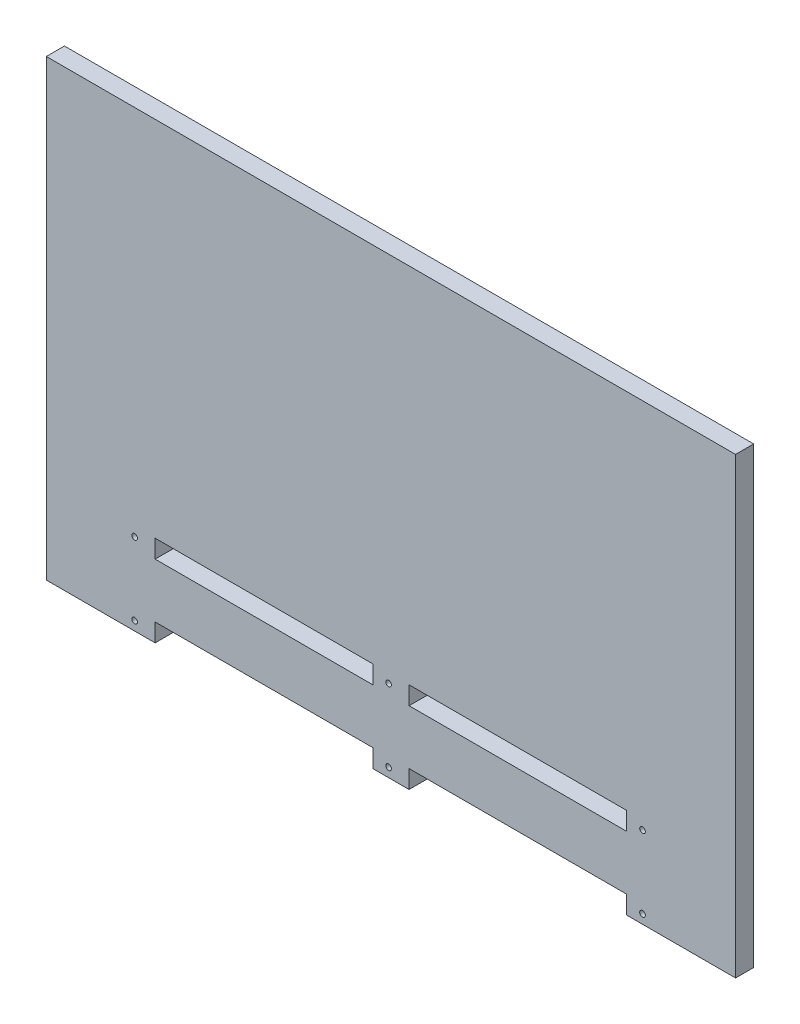
ISO-10303-21;
HEADER;
FILE_DESCRIPTION(('STEP AP214'),'2;1');
FILE_NAME('part.step','',(''),(''),'','','');
FILE_SCHEMA(('AUTOMOTIVE_DESIGN { 1 0 10303 214 1 1 1 1 }'));
ENDSEC;
DATA;
#1=APPLICATION_CONTEXT('core data for automotive mechanical design processes');
#2=APPLICATION_PROTOCOL_DEFINITION('international standard','automotive_design',2000,#1);
#3=PRODUCT_CONTEXT('',#1,'mechanical');
#4=PRODUCT('Part','Part','',(#3));
#5=PRODUCT_RELATED_PRODUCT_CATEGORY('part','',(#4));
#6=PRODUCT_DEFINITION_FORMATION('','',#4);
#7=PRODUCT_DEFINITION_CONTEXT('part definition',#1,'design');
#8=PRODUCT_DEFINITION('design','',#6,#7);
#9=PRODUCT_DEFINITION_SHAPE('','',#8);
#10=(LENGTH_UNIT() NAMED_UNIT(*) SI_UNIT(.MILLI.,.METRE.));
#11=(NAMED_UNIT(*) PLANE_ANGLE_UNIT() SI_UNIT($,.RADIAN.));
#12=(NAMED_UNIT(*) SI_UNIT($,.STERADIAN.) SOLID_ANGLE_UNIT());
#13=UNCERTAINTY_MEASURE_WITH_UNIT(LENGTH_MEASURE(1.E-05),#10,'distance_accuracy_value','');
#14=(GEOMETRIC_REPRESENTATION_CONTEXT(3) GLOBAL_UNCERTAINTY_ASSIGNED_CONTEXT((#13)) GLOBAL_UNIT_ASSIGNED_CONTEXT((#10,
#11,#12)) REPRESENTATION_CONTEXT('',''));
#15=CARTESIAN_POINT('',(0.,0.,0.));
#16=DIRECTION('',(0.,0.,1.));
#17=DIRECTION('',(1.,0.,0.));
#18=AXIS2_PLACEMENT_3D('',#15,#16,#17);
#19=CARTESIAN_POINT('',(0.,-200.,10.));
#20=DIRECTION('',(0.,1.,0.));
#21=DIRECTION('',(-1.,0.,0.));
#22=AXIS2_PLACEMENT_3D('',#19,#20,#21);
#23=PLANE('',#22);
#24=DIRECTION('',(1.,0.,0.));
#25=VECTOR('',#24,1.);
#26=CARTESIAN_POINT('',(0.,-200.,0.));
#27=LINE('',#26,#25);
#28=CARTESIAN_POINT('',(10.,-200.,0.));
#29=VERTEX_POINT('',#28);
#30=CARTESIAN_POINT('',(130.,-200.,0.));
#31=VERTEX_POINT('',#30);
#32=EDGE_CURVE('E264',#29,#31,#27,.T.);
#33=ORIENTED_EDGE('',*,*,#32,.T.);
#34=DIRECTION('',(0.,0.,-1.));
#35=VECTOR('',#34,1.);
#36=CARTESIAN_POINT('',(130.,-200.,10.));
#37=LINE('',#36,#35);
#38=CARTESIAN_POINT('',(130.,-200.,10.));
#39=VERTEX_POINT('',#38);
#40=EDGE_CURVE('E11',#39,#31,#37,.T.);
#41=ORIENTED_EDGE('',*,*,#40,.F.);
#42=DIRECTION('',(1.,0.,0.));
#43=VECTOR('',#42,1.);
#44=CARTESIAN_POINT('',(0.,-200.,10.));
#45=LINE('',#44,#43);
#46=CARTESIAN_POINT('',(10.,-200.,10.));
#47=VERTEX_POINT('',#46);
#48=EDGE_CURVE('E186',#47,#39,#45,.T.);
#49=ORIENTED_EDGE('',*,*,#48,.F.);
#50=DIRECTION('',(0.,0.,-1.));
#51=VECTOR('',#50,1.);
#52=CARTESIAN_POINT('',(10.,-200.,10.));
#53=LINE('',#52,#51);
#54=EDGE_CURVE('E54',#47,#29,#53,.T.);
#55=ORIENTED_EDGE('',*,*,#54,.T.);
#56=EDGE_LOOP('',(#33,#41,#49,#55));
#57=FACE_BOUND('',#56,.T.);
#58=ADVANCED_FACE('F35',(#57),#23,.F.);
#59=CARTESIAN_POINT('',(129.999999999999,3.60822483003174E-13,10.));
#60=DIRECTION('',(1.,0.,0.));
#61=DIRECTION('',(0.,1.,0.));
#62=AXIS2_PLACEMENT_3D('',#59,#60,#61);
#63=PLANE('',#62);
#64=DIRECTION('',(0.,-1.,0.));
#65=VECTOR('',#64,1.);
#66=CARTESIAN_POINT('',(129.999999999999,3.60822483003174E-13,0.));
#67=LINE('',#66,#65);
#68=CARTESIAN_POINT('',(130.,-210.,0.));
#69=VERTEX_POINT('',#68);
#70=EDGE_CURVE('E192',#31,#69,#67,.T.);
#71=ORIENTED_EDGE('',*,*,#70,.T.);
#72=DIRECTION('',(0.,0.,-1.));
#73=VECTOR('',#72,1.);
#74=CARTESIAN_POINT('',(130.,-210.,10.));
#75=LINE('',#74,#73);
#76=CARTESIAN_POINT('',(130.,-210.,10.));
#77=VERTEX_POINT('',#76);
#78=EDGE_CURVE('E45',#77,#69,#75,.T.);
#79=ORIENTED_EDGE('',*,*,#78,.F.);
#80=DIRECTION('',(0.,-1.,0.));
#81=VECTOR('',#80,1.);
#82=CARTESIAN_POINT('',(129.999999999999,3.60822483003174E-13,10.));
#83=LINE('',#82,#81);
#84=EDGE_CURVE('E180',#39,#77,#83,.T.);
#85=ORIENTED_EDGE('',*,*,#84,.F.);
#86=ORIENTED_EDGE('',*,*,#40,.T.);
#87=EDGE_LOOP('',(#71,#79,#85,#86));
#88=FACE_BOUND('',#87,.T.);
#89=ADVANCED_FACE('F191',(#88),#63,.F.);
#90=CARTESIAN_POINT('',(0.,-210.,10.));
#91=DIRECTION('',(0.,1.,0.));
#92=DIRECTION('',(-1.,0.,0.));
#93=AXIS2_PLACEMENT_3D('',#90,#91,#92);
#94=PLANE('',#93);
#95=DIRECTION('',(1.,0.,0.));
#96=VECTOR('',#95,1.);
#97=CARTESIAN_POINT('',(0.,-210.,0.));
#98=LINE('',#97,#96);
#99=CARTESIAN_POINT('',(10.,-210.,0.));
#100=VERTEX_POINT('',#99);
#101=EDGE_CURVE('E267',#100,#69,#98,.T.);
#102=ORIENTED_EDGE('',*,*,#101,.F.);
#103=DIRECTION('',(0.,0.,-1.));
#104=VECTOR('',#103,1.);
#105=CARTESIAN_POINT('',(10.,-210.,10.));
#106=LINE('',#105,#104);
#107=CARTESIAN_POINT('',(10.,-210.,10.));
#108=VERTEX_POINT('',#107);
#109=EDGE_CURVE('E116',#108,#100,#106,.T.);
#110=ORIENTED_EDGE('',*,*,#109,.F.);
#111=DIRECTION('',(1.,0.,0.));
#112=VECTOR('',#111,1.);
#113=CARTESIAN_POINT('',(0.,-210.,10.));
#114=LINE('',#113,#112);
#115=EDGE_CURVE('E185',#108,#77,#114,.T.);
#116=ORIENTED_EDGE('',*,*,#115,.T.);
#117=ORIENTED_EDGE('',*,*,#78,.T.);
#118=EDGE_LOOP('',(#102,#110,#116,#117));
#119=FACE_BOUND('',#118,.T.);
#120=ADVANCED_FACE('F196',(#119),#94,.T.);
#121=CARTESIAN_POINT('',(0.,-210.,10.));
#122=DIRECTION('',(0.,1.,0.));
#123=DIRECTION('',(0.,0.,1.));
#124=AXIS2_PLACEMENT_3D('',#121,#122,#123);
#125=PLANE('',#124);
#126=DIRECTION('',(1.,0.,0.));
#127=VECTOR('',#126,1.);
#128=CARTESIAN_POINT('',(0.,-210.,0.));
#129=LINE('',#128,#127);
#130=CARTESIAN_POINT('',(-130.,-210.,0.));
#131=VERTEX_POINT('',#130);
#132=CARTESIAN_POINT('',(-10.,-210.,0.));
#133=VERTEX_POINT('',#132);
#134=EDGE_CURVE('E252',#131,#133,#129,.T.);
#135=ORIENTED_EDGE('',*,*,#134,.F.);
#136=DIRECTION('',(0.,0.,-1.));
#137=VECTOR('',#136,1.);
#138=CARTESIAN_POINT('',(-130.,-210.,10.));
#139=LINE('',#138,#137);
#140=CARTESIAN_POINT('',(-130.,-210.,10.));
#141=VERTEX_POINT('',#140);
#142=EDGE_CURVE('E274',#141,#131,#139,.T.);
#143=ORIENTED_EDGE('',*,*,#142,.F.);
#144=DIRECTION('',(1.,0.,0.));
#145=VECTOR('',#144,1.);
#146=CARTESIAN_POINT('',(0.,-210.,10.));
#147=LINE('',#146,#145);
#148=CARTESIAN_POINT('',(-10.,-210.,10.));
#149=VERTEX_POINT('',#148);
#150=EDGE_CURVE('E371',#141,#149,#147,.T.);
#151=ORIENTED_EDGE('',*,*,#150,.T.);
#152=DIRECTION('',(0.,0.,-1.));
#153=VECTOR('',#152,1.);
#154=CARTESIAN_POINT('',(-10.,-210.,10.));
#155=LINE('',#154,#153);
#156=EDGE_CURVE('E276',#149,#133,#155,.T.);
#157=ORIENTED_EDGE('',*,*,#156,.T.);
#158=EDGE_LOOP('',(#135,#143,#151,#157));
#159=FACE_BOUND('',#158,.T.);
#160=ADVANCED_FACE('F391',(#159),#125,.T.);
#161=CARTESIAN_POINT('',(-130.,0.,10.));
#162=DIRECTION('',(1.,0.,0.));
#163=DIRECTION('',(0.,0.,-1.));
#164=AXIS2_PLACEMENT_3D('',#161,#162,#163);
#165=PLANE('',#164);
#166=DIRECTION('',(0.,-1.,0.));
#167=VECTOR('',#166,1.);
#168=CARTESIAN_POINT('',(-130.,0.,0.));
#169=LINE('',#168,#167);
#170=CARTESIAN_POINT('',(-130.,-200.,0.));
#171=VERTEX_POINT('',#170);
#172=EDGE_CURVE('E255',#171,#131,#169,.T.);
#173=ORIENTED_EDGE('',*,*,#172,.F.);
#174=DIRECTION('',(0.,0.,-1.));
#175=VECTOR('',#174,1.);
#176=CARTESIAN_POINT('',(-130.,-200.,10.));
#177=LINE('',#176,#175);
#178=CARTESIAN_POINT('',(-130.,-200.,10.));
#179=VERTEX_POINT('',#178);
#180=EDGE_CURVE('E281',#179,#171,#177,.T.);
#181=ORIENTED_EDGE('',*,*,#180,.F.);
#182=DIRECTION('',(0.,-1.,0.));
#183=VECTOR('',#182,1.);
#184=CARTESIAN_POINT('',(-130.,0.,10.));
#185=LINE('',#184,#183);
#186=EDGE_CURVE('E374',#179,#141,#185,.T.);
#187=ORIENTED_EDGE('',*,*,#186,.T.);
#188=ORIENTED_EDGE('',*,*,#142,.T.);
#189=EDGE_LOOP('',(#173,#181,#187,#188));
#190=FACE_BOUND('',#189,.T.);
#191=ADVANCED_FACE('F394',(#190),#165,.T.);
#192=CARTESIAN_POINT('',(0.,-200.,10.));
#193=DIRECTION('',(0.,1.,0.));
#194=DIRECTION('',(0.,0.,1.));
#195=AXIS2_PLACEMENT_3D('',#192,#193,#194);
#196=PLANE('',#195);
#197=DIRECTION('',(1.,0.,0.));
#198=VECTOR('',#197,1.);
#199=CARTESIAN_POINT('',(0.,-200.,0.));
#200=LINE('',#199,#198);
#201=CARTESIAN_POINT('',(-10.,-200.,0.));
#202=VERTEX_POINT('',#201);
#203=EDGE_CURVE('E258',#171,#202,#200,.T.);
#204=ORIENTED_EDGE('',*,*,#203,.T.);
#205=DIRECTION('',(0.,0.,-1.));
#206=VECTOR('',#205,1.);
#207=CARTESIAN_POINT('',(-10.,-200.,10.));
#208=LINE('',#207,#206);
#209=CARTESIAN_POINT('',(-10.,-200.,10.));
#210=VERTEX_POINT('',#209);
#211=EDGE_CURVE('E278',#210,#202,#208,.T.);
#212=ORIENTED_EDGE('',*,*,#211,.F.);
#213=DIRECTION('',(1.,0.,0.));
#214=VECTOR('',#213,1.);
#215=CARTESIAN_POINT('',(0.,-200.,10.));
#216=LINE('',#215,#214);
#217=EDGE_CURVE('E377',#179,#210,#216,.T.);
#218=ORIENTED_EDGE('',*,*,#217,.F.);
#219=ORIENTED_EDGE('',*,*,#180,.T.);
#220=EDGE_LOOP('',(#204,#212,#218,#219));
#221=FACE_BOUND('',#220,.T.);
#222=ADVANCED_FACE('F397',(#221),#196,.F.);
#223=CARTESIAN_POINT('',(-190.,0.,10.));
#224=DIRECTION('',(-1.,0.,0.));
#225=DIRECTION('',(0.,0.,1.));
#226=AXIS2_PLACEMENT_3D('',#223,#224,#225);
#227=PLANE('',#226);
#228=DIRECTION('',(0.,1.,0.));
#229=VECTOR('',#228,1.);
#230=CARTESIAN_POINT('',(-190.,0.,0.));
#231=LINE('',#230,#229);
#232=CARTESIAN_POINT('',(-190.,-250.,0.));
#233=VERTEX_POINT('',#232);
#234=CARTESIAN_POINT('',(-190.,0.,0.));
#235=VERTEX_POINT('',#234);
#236=EDGE_CURVE('E203',#233,#235,#231,.T.);
#237=ORIENTED_EDGE('',*,*,#236,.F.);
#238=DIRECTION('',(0.,0.,-1.));
#239=VECTOR('',#238,1.);
#240=CARTESIAN_POINT('',(-190.,-250.,10.));
#241=LINE('',#240,#239);
#242=CARTESIAN_POINT('',(-190.,-250.,10.));
#243=VERTEX_POINT('',#242);
#244=EDGE_CURVE('E39',#243,#233,#241,.T.);
#245=ORIENTED_EDGE('',*,*,#244,.F.);
#246=DIRECTION('',(0.,1.,0.));
#247=VECTOR('',#246,1.);
#248=CARTESIAN_POINT('',(-190.,0.,10.));
#249=LINE('',#248,#247);
#250=CARTESIAN_POINT('',(-190.,0.,10.));
#251=VERTEX_POINT('',#250);
#252=EDGE_CURVE('E272',#243,#251,#249,.T.);
#253=ORIENTED_EDGE('',*,*,#252,.T.);
#254=DIRECTION('',(0.,0.,-1.));
#255=VECTOR('',#254,1.);
#256=CARTESIAN_POINT('',(-190.,0.,10.));
#257=LINE('',#256,#255);
#258=EDGE_CURVE('E199',#251,#235,#257,.T.);
#259=ORIENTED_EDGE('',*,*,#258,.T.);
#260=EDGE_LOOP('',(#237,#245,#253,#259));
#261=FACE_BOUND('',#260,.T.);
#262=ADVANCED_FACE('F37',(#261),#227,.T.);
#263=CARTESIAN_POINT('',(0.,-250.,10.));
#264=DIRECTION('',(0.,-1.,0.));
#265=DIRECTION('',(0.,0.,-1.));
#266=AXIS2_PLACEMENT_3D('',#263,#264,#265);
#267=PLANE('',#266);
#268=DIRECTION('',(-1.,0.,0.));
#269=VECTOR('',#268,1.);
#270=CARTESIAN_POINT('',(0.,-250.,0.));
#271=LINE('',#270,#269);
#272=CARTESIAN_POINT('',(-130.,-250.,0.));
#273=VERTEX_POINT('',#272);
#274=EDGE_CURVE('E206',#273,#233,#271,.T.);
#275=ORIENTED_EDGE('',*,*,#274,.F.);
#276=DIRECTION('',(0.,0.,-1.));
#277=VECTOR('',#276,1.);
#278=CARTESIAN_POINT('',(-130.,-250.,10.));
#279=LINE('',#278,#277);
#280=CARTESIAN_POINT('',(-130.,-250.,10.));
#281=VERTEX_POINT('',#280);
#282=EDGE_CURVE('E305',#281,#273,#279,.T.);
#283=ORIENTED_EDGE('',*,*,#282,.F.);
#284=DIRECTION('',(-1.,0.,0.));
#285=VECTOR('',#284,1.);
#286=CARTESIAN_POINT('',(0.,-250.,10.));
#287=LINE('',#286,#285);
#288=EDGE_CURVE('E314',#281,#243,#287,.T.);
#289=ORIENTED_EDGE('',*,*,#288,.T.);
#290=ORIENTED_EDGE('',*,*,#244,.T.);
#291=EDGE_LOOP('',(#275,#283,#289,#290));
#292=FACE_BOUND('',#291,.T.);
#293=ADVANCED_FACE('F312',(#292),#267,.T.);
#294=CARTESIAN_POINT('',(-130.,0.,10.));
#295=DIRECTION('',(-1.,0.,0.));
#296=DIRECTION('',(0.,0.,1.));
#297=AXIS2_PLACEMENT_3D('',#294,#295,#296);
#298=PLANE('',#297);
#299=DIRECTION('',(0.,1.,0.));
#300=VECTOR('',#299,1.);
#301=CARTESIAN_POINT('',(-130.,0.,0.));
#302=LINE('',#301,#300);
#303=CARTESIAN_POINT('',(-130.,-240.,0.));
#304=VERTEX_POINT('',#303);
#305=EDGE_CURVE('E209',#273,#304,#302,.T.);
#306=ORIENTED_EDGE('',*,*,#305,.T.);
#307=DIRECTION('',(0.,0.,-1.));
#308=VECTOR('',#307,1.);
#309=CARTESIAN_POINT('',(-130.,-240.,10.));
#310=LINE('',#309,#308);
#311=CARTESIAN_POINT('',(-130.,-240.,10.));
#312=VERTEX_POINT('',#311);
#313=EDGE_CURVE('E303',#312,#304,#310,.T.);
#314=ORIENTED_EDGE('',*,*,#313,.F.);
#315=DIRECTION('',(0.,1.,0.));
#316=VECTOR('',#315,1.);
#317=CARTESIAN_POINT('',(-130.,0.,10.));
#318=LINE('',#317,#316);
#319=EDGE_CURVE('E332',#281,#312,#318,.T.);
#320=ORIENTED_EDGE('',*,*,#319,.F.);
#321=ORIENTED_EDGE('',*,*,#282,.T.);
#322=EDGE_LOOP('',(#306,#314,#320,#321));
#323=FACE_BOUND('',#322,.T.);
#324=ADVANCED_FACE('F322',(#323),#298,.F.);
#325=CARTESIAN_POINT('',(0.,-240.,10.));
#326=DIRECTION('',(0.,1.,0.));
#327=DIRECTION('',(0.,0.,1.));
#328=AXIS2_PLACEMENT_3D('',#325,#326,#327);
#329=PLANE('',#328);
#330=DIRECTION('',(1.,0.,0.));
#331=VECTOR('',#330,1.);
#332=CARTESIAN_POINT('',(0.,-240.,0.));
#333=LINE('',#332,#331);
#334=CARTESIAN_POINT('',(-9.99999999999998,-240.,0.));
#335=VERTEX_POINT('',#334);
#336=EDGE_CURVE('E211',#304,#335,#333,.T.);
#337=ORIENTED_EDGE('',*,*,#336,.T.);
#338=DIRECTION('',(0.,0.,-1.));
#339=VECTOR('',#338,1.);
#340=CARTESIAN_POINT('',(-9.99999999999998,-240.,10.));
#341=LINE('',#340,#339);
#342=CARTESIAN_POINT('',(-9.99999999999998,-240.,10.));
#343=VERTEX_POINT('',#342);
#344=EDGE_CURVE('E301',#343,#335,#341,.T.);
#345=ORIENTED_EDGE('',*,*,#344,.F.);
#346=DIRECTION('',(1.,0.,0.));
#347=VECTOR('',#346,1.);
#348=CARTESIAN_POINT('',(0.,-240.,10.));
#349=LINE('',#348,#347);
#350=EDGE_CURVE('E327',#312,#343,#349,.T.);
#351=ORIENTED_EDGE('',*,*,#350,.F.);
#352=ORIENTED_EDGE('',*,*,#313,.T.);
#353=EDGE_LOOP('',(#337,#345,#351,#352));
#354=FACE_BOUND('',#353,.T.);
#355=ADVANCED_FACE('F325',(#354),#329,.F.);
#356=CARTESIAN_POINT('',(-9.99999999999977,0.,10.));
#357=DIRECTION('',(-1.,0.,0.));
#358=DIRECTION('',(0.,-1.,0.));
#359=AXIS2_PLACEMENT_3D('',#356,#357,#358);
#360=PLANE('',#359);
#361=DIRECTION('',(0.,1.,0.));
#362=VECTOR('',#361,1.);
#363=CARTESIAN_POINT('',(-9.99999999999977,0.,0.));
#364=LINE('',#363,#362);
#365=CARTESIAN_POINT('',(-9.99999999999999,-250.,0.));
#366=VERTEX_POINT('',#365);
#367=EDGE_CURVE('E214',#366,#335,#364,.T.);
#368=ORIENTED_EDGE('',*,*,#367,.F.);
#369=DIRECTION('',(0.,0.,-1.));
#370=VECTOR('',#369,1.);
#371=CARTESIAN_POINT('',(-9.99999999999999,-250.,10.));
#372=LINE('',#371,#370);
#373=CARTESIAN_POINT('',(-9.99999999999999,-250.,10.));
#374=VERTEX_POINT('',#373);
#375=EDGE_CURVE('E299',#374,#366,#372,.T.);
#376=ORIENTED_EDGE('',*,*,#375,.F.);
#377=DIRECTION('',(0.,1.,0.));
#378=VECTOR('',#377,1.);
#379=CARTESIAN_POINT('',(-9.99999999999977,0.,10.));
#380=LINE('',#379,#378);
#381=EDGE_CURVE('E331',#374,#343,#380,.T.);
#382=ORIENTED_EDGE('',*,*,#381,.T.);
#383=ORIENTED_EDGE('',*,*,#344,.T.);
#384=EDGE_LOOP('',(#368,#376,#382,#383));
#385=FACE_BOUND('',#384,.T.);
#386=ADVANCED_FACE('F474',(#385),#360,.T.);
#387=CARTESIAN_POINT('',(0.,-250.,10.));
#388=DIRECTION('',(0.,1.,0.));
#389=DIRECTION('',(0.,0.,1.));
#390=AXIS2_PLACEMENT_3D('',#387,#388,#389);
#391=PLANE('',#390);
#392=DIRECTION('',(1.,0.,0.));
#393=VECTOR('',#392,1.);
#394=CARTESIAN_POINT('',(0.,-250.,0.));
#395=LINE('',#394,#393);
#396=CARTESIAN_POINT('',(10.,-250.,0.));
#397=VERTEX_POINT('',#396);
#398=EDGE_CURVE('E217',#366,#397,#395,.T.);
#399=ORIENTED_EDGE('',*,*,#398,.T.);
#400=DIRECTION('',(0.,0.,-1.));
#401=VECTOR('',#400,1.);
#402=CARTESIAN_POINT('',(10.,-250.,10.));
#403=LINE('',#402,#401);
#404=CARTESIAN_POINT('',(10.,-250.,10.));
#405=VERTEX_POINT('',#404);
#406=EDGE_CURVE('E296',#405,#397,#403,.T.);
#407=ORIENTED_EDGE('',*,*,#406,.F.);
#408=DIRECTION('',(1.,0.,0.));
#409=VECTOR('',#408,1.);
#410=CARTESIAN_POINT('',(0.,-250.,10.));
#411=LINE('',#410,#409);
#412=EDGE_CURVE('E334',#374,#405,#411,.T.);
#413=ORIENTED_EDGE('',*,*,#412,.F.);
#414=ORIENTED_EDGE('',*,*,#375,.T.);
#415=EDGE_LOOP('',(#399,#407,#413,#414));
#416=FACE_BOUND('',#415,.T.);
#417=ADVANCED_FACE('F462',(#416),#391,.F.);
#418=CARTESIAN_POINT('',(9.99999999999993,0.,10.));
#419=DIRECTION('',(-1.,0.,0.));
#420=DIRECTION('',(0.,-1.,0.));
#421=AXIS2_PLACEMENT_3D('',#418,#419,#420);
#422=PLANE('',#421);
#423=DIRECTION('',(0.,1.,0.));
#424=VECTOR('',#423,1.);
#425=CARTESIAN_POINT('',(9.99999999999993,0.,0.));
#426=LINE('',#425,#424);
#427=CARTESIAN_POINT('',(10.,-240.,0.));
#428=VERTEX_POINT('',#427);
#429=EDGE_CURVE('E219',#397,#428,#426,.T.);
#430=ORIENTED_EDGE('',*,*,#429,.T.);
#431=DIRECTION('',(0.,0.,-1.));
#432=VECTOR('',#431,1.);
#433=CARTESIAN_POINT('',(10.,-240.,10.));
#434=LINE('',#433,#432);
#435=CARTESIAN_POINT('',(10.,-240.,10.));
#436=VERTEX_POINT('',#435);
#437=EDGE_CURVE('E293',#436,#428,#434,.T.);
#438=ORIENTED_EDGE('',*,*,#437,.F.);
#439=DIRECTION('',(0.,1.,0.));
#440=VECTOR('',#439,1.);
#441=CARTESIAN_POINT('',(9.99999999999993,0.,10.));
#442=LINE('',#441,#440);
#443=EDGE_CURVE('E340',#405,#436,#442,.T.);
#444=ORIENTED_EDGE('',*,*,#443,.F.);
#445=ORIENTED_EDGE('',*,*,#406,.T.);
#446=EDGE_LOOP('',(#430,#438,#444,#445));
#447=FACE_BOUND('',#446,.T.);
#448=ADVANCED_FACE('F469',(#447),#422,.F.);
#449=CARTESIAN_POINT('',(0.,-240.,10.));
#450=DIRECTION('',(0.,1.,0.));
#451=DIRECTION('',(0.,0.,1.));
#452=AXIS2_PLACEMENT_3D('',#449,#450,#451);
#453=PLANE('',#452);
#454=DIRECTION('',(1.,0.,0.));
#455=VECTOR('',#454,1.);
#456=CARTESIAN_POINT('',(0.,-240.,0.));
#457=LINE('',#456,#455);
#458=CARTESIAN_POINT('',(130.,-240.,0.));
#459=VERTEX_POINT('',#458);
#460=EDGE_CURVE('E222',#428,#459,#457,.T.);
#461=ORIENTED_EDGE('',*,*,#460,.T.);
#462=DIRECTION('',(0.,0.,-1.));
#463=VECTOR('',#462,1.);
#464=CARTESIAN_POINT('',(130.,-240.,10.));
#465=LINE('',#464,#463);
#466=CARTESIAN_POINT('',(130.,-240.,10.));
#467=VERTEX_POINT('',#466);
#468=EDGE_CURVE('E291',#467,#459,#465,.T.);
#469=ORIENTED_EDGE('',*,*,#468,.F.);
#470=DIRECTION('',(1.,0.,0.));
#471=VECTOR('',#470,1.);
#472=CARTESIAN_POINT('',(0.,-240.,10.));
#473=LINE('',#472,#471);
#474=EDGE_CURVE('E343',#436,#467,#473,.T.);
#475=ORIENTED_EDGE('',*,*,#474,.F.);
#476=ORIENTED_EDGE('',*,*,#437,.T.);
#477=EDGE_LOOP('',(#461,#469,#475,#476));
#478=FACE_BOUND('',#477,.T.);
#479=ADVANCED_FACE('F465',(#478),#453,.F.);
#480=CARTESIAN_POINT('',(130.,0.,10.));
#481=DIRECTION('',(-1.,0.,0.));
#482=DIRECTION('',(0.,0.,1.));
#483=AXIS2_PLACEMENT_3D('',#480,#481,#482);
#484=PLANE('',#483);
#485=DIRECTION('',(0.,1.,0.));
#486=VECTOR('',#485,1.);
#487=CARTESIAN_POINT('',(130.,0.,0.));
#488=LINE('',#487,#486);
#489=CARTESIAN_POINT('',(130.,-250.,0.));
#490=VERTEX_POINT('',#489);
#491=EDGE_CURVE('E225',#490,#459,#488,.T.);
#492=ORIENTED_EDGE('',*,*,#491,.F.);
#493=DIRECTION('',(0.,0.,-1.));
#494=VECTOR('',#493,1.);
#495=CARTESIAN_POINT('',(130.,-250.,10.));
#496=LINE('',#495,#494);
#497=CARTESIAN_POINT('',(130.,-250.,10.));
#498=VERTEX_POINT('',#497);
#499=EDGE_CURVE('E289',#498,#490,#496,.T.);
#500=ORIENTED_EDGE('',*,*,#499,.F.);
#501=DIRECTION('',(0.,1.,0.));
#502=VECTOR('',#501,1.);
#503=CARTESIAN_POINT('',(130.,0.,10.));
#504=LINE('',#503,#502);
#505=EDGE_CURVE('E345',#498,#467,#504,.T.);
#506=ORIENTED_EDGE('',*,*,#505,.T.);
#507=ORIENTED_EDGE('',*,*,#468,.T.);
#508=EDGE_LOOP('',(#492,#500,#506,#507));
#509=FACE_BOUND('',#508,.T.);
#510=ADVANCED_FACE('F460',(#509),#484,.T.);
#511=CARTESIAN_POINT('',(190.,-250.,0.));
#512=VERTEX_POINT('',#511);
#513=EDGE_CURVE('E220',#490,#512,#395,.T.);
#514=ORIENTED_EDGE('',*,*,#513,.T.);
#515=DIRECTION('',(0.,0.,-1.));
#516=VECTOR('',#515,1.);
#517=CARTESIAN_POINT('',(190.,-250.,10.));
#518=LINE('',#517,#516);
#519=CARTESIAN_POINT('',(190.,-250.,10.));
#520=VERTEX_POINT('',#519);
#521=EDGE_CURVE('E287',#520,#512,#518,.T.);
#522=ORIENTED_EDGE('',*,*,#521,.F.);
#523=EDGE_CURVE('E341',#498,#520,#411,.T.);
#524=ORIENTED_EDGE('',*,*,#523,.F.);
#525=ORIENTED_EDGE('',*,*,#499,.T.);
#526=EDGE_LOOP('',(#514,#522,#524,#525));
#527=FACE_BOUND('',#526,.T.);
#528=ADVANCED_FACE('F456',(#527),#391,.F.);
#529=CARTESIAN_POINT('',(190.,0.,10.));
#530=DIRECTION('',(1.,0.,0.));
#531=DIRECTION('',(0.,1.,0.));
#532=AXIS2_PLACEMENT_3D('',#529,#530,#531);
#533=PLANE('',#532);
#534=DIRECTION('',(0.,-1.,0.));
#535=VECTOR('',#534,1.);
#536=CARTESIAN_POINT('',(190.,0.,0.));
#537=LINE('',#536,#535);
#538=CARTESIAN_POINT('',(190.,0.,0.));
#539=VERTEX_POINT('',#538);
#540=EDGE_CURVE('E228',#539,#512,#537,.T.);
#541=ORIENTED_EDGE('',*,*,#540,.F.);
#542=DIRECTION('',(0.,0.,-1.));
#543=VECTOR('',#542,1.);
#544=CARTESIAN_POINT('',(190.,0.,10.));
#545=LINE('',#544,#543);
#546=CARTESIAN_POINT('',(190.,0.,10.));
#547=VERTEX_POINT('',#546);
#548=EDGE_CURVE('E285',#547,#539,#545,.T.);
#549=ORIENTED_EDGE('',*,*,#548,.F.);
#550=DIRECTION('',(0.,-1.,0.));
#551=VECTOR('',#550,1.);
#552=CARTESIAN_POINT('',(190.,0.,10.));
#553=LINE('',#552,#551);
#554=EDGE_CURVE('E348',#547,#520,#553,.T.);
#555=ORIENTED_EDGE('',*,*,#554,.T.);
#556=ORIENTED_EDGE('',*,*,#521,.T.);
#557=EDGE_LOOP('',(#541,#549,#555,#556));
#558=FACE_BOUND('',#557,.T.);
#559=ADVANCED_FACE('F425',(#558),#533,.T.);
#560=CARTESIAN_POINT('',(-10.,0.,10.));
#561=DIRECTION('',(1.,0.,0.));
#562=DIRECTION('',(0.,0.,-1.));
#563=AXIS2_PLACEMENT_3D('',#560,#561,#562);
#564=PLANE('',#563);
#565=DIRECTION('',(0.,-1.,0.));
#566=VECTOR('',#565,1.);
#567=CARTESIAN_POINT('',(-10.,0.,0.));
#568=LINE('',#567,#566);
#569=EDGE_CURVE('E261',#202,#133,#568,.T.);
#570=ORIENTED_EDGE('',*,*,#569,.T.);
#571=ORIENTED_EDGE('',*,*,#156,.F.);
#572=DIRECTION('',(0.,-1.,0.));
#573=VECTOR('',#572,1.);
#574=CARTESIAN_POINT('',(-10.,0.,10.));
#575=LINE('',#574,#573);
#576=EDGE_CURVE('E380',#210,#149,#575,.T.);
#577=ORIENTED_EDGE('',*,*,#576,.F.);
#578=ORIENTED_EDGE('',*,*,#211,.T.);
#579=EDGE_LOOP('',(#570,#571,#577,#578));
#580=FACE_BOUND('',#579,.T.);
#581=ADVANCED_FACE('F388',(#580),#564,.F.);
#582=CARTESIAN_POINT('',(-141.295330694007,-245.,10.));
#583=DIRECTION('',(0.,0.,-1.));
#584=DIRECTION('',(-1.,0.,0.));
#585=AXIS2_PLACEMENT_3D('',#582,#583,#584);
#586=CYLINDRICAL_SURFACE('',#585,1.54999999999999);
#587=CARTESIAN_POINT('',(-141.295330694007,-245.,10.));
#588=DIRECTION('',(0.,0.,1.));
#589=DIRECTION('',(1.,0.,0.));
#590=AXIS2_PLACEMENT_3D('',#587,#588,#589);
#591=CIRCLE('',#590,1.54999999999999);
#592=CARTESIAN_POINT('',(-139.745330694007,-245.,10.));
#593=VERTEX_POINT('',#592);
#594=EDGE_CURVE('E368',#593,#593,#591,.T.);
#595=ORIENTED_EDGE('',*,*,#594,.T.);
#596=EDGE_LOOP('',(#595));
#597=FACE_BOUND('',#596,.T.);
#598=CARTESIAN_POINT('',(-141.295330694007,-245.,0.));
#599=DIRECTION('',(0.,0.,1.));
#600=DIRECTION('',(1.,0.,0.));
#601=AXIS2_PLACEMENT_3D('',#598,#599,#600);
#602=CIRCLE('',#601,1.54999999999999);
#603=CARTESIAN_POINT('',(-139.745330694007,-245.,0.));
#604=VERTEX_POINT('',#603);
#605=EDGE_CURVE('E249',#604,#604,#602,.T.);
#606=ORIENTED_EDGE('',*,*,#605,.F.);
#607=EDGE_LOOP('',(#606));
#608=FACE_BOUND('',#607,.T.);
#609=ADVANCED_FACE('F424',(#597,#608),#586,.F.);
#610=CARTESIAN_POINT('',(-1.29533069400678,-245.,10.));
#611=DIRECTION('',(0.,0.,-1.));
#612=DIRECTION('',(-1.,0.,0.));
#613=AXIS2_PLACEMENT_3D('',#610,#611,#612);
#614=CYLINDRICAL_SURFACE('',#613,1.54999999999999);
#615=CARTESIAN_POINT('',(-1.29533069400678,-245.,10.));
#616=DIRECTION('',(0.,0.,1.));
#617=DIRECTION('',(1.,0.,0.));
#618=AXIS2_PLACEMENT_3D('',#615,#616,#617);
#619=CIRCLE('',#618,1.54999999999999);
#620=CARTESIAN_POINT('',(0.254669305993213,-245.,10.));
#621=VERTEX_POINT('',#620);
#622=EDGE_CURVE('E365',#621,#621,#619,.T.);
#623=ORIENTED_EDGE('',*,*,#622,.T.);
#624=EDGE_LOOP('',(#623));
#625=FACE_BOUND('',#624,.T.);
#626=CARTESIAN_POINT('',(-1.29533069400678,-245.,0.));
#627=DIRECTION('',(0.,0.,1.));
#628=DIRECTION('',(1.,0.,0.));
#629=AXIS2_PLACEMENT_3D('',#626,#627,#628);
#630=CIRCLE('',#629,1.54999999999999);
#631=CARTESIAN_POINT('',(0.254669305993213,-245.,0.));
#632=VERTEX_POINT('',#631);
#633=EDGE_CURVE('E246',#632,#632,#630,.T.);
#634=ORIENTED_EDGE('',*,*,#633,.F.);
#635=EDGE_LOOP('',(#634));
#636=FACE_BOUND('',#635,.T.);
#637=ADVANCED_FACE('F434',(#625,#636),#614,.F.);
#638=CARTESIAN_POINT('',(138.704669305993,-245.,10.));
#639=DIRECTION('',(0.,0.,-1.));
#640=DIRECTION('',(-1.,0.,0.));
#641=AXIS2_PLACEMENT_3D('',#638,#639,#640);
#642=CYLINDRICAL_SURFACE('',#641,1.54999999999999);
#643=CARTESIAN_POINT('',(138.704669305993,-245.,10.));
#644=DIRECTION('',(0.,0.,1.));
#645=DIRECTION('',(1.,0.,0.));
#646=AXIS2_PLACEMENT_3D('',#643,#644,#645);
#647=CIRCLE('',#646,1.54999999999999);
#648=CARTESIAN_POINT('',(140.254669305993,-245.,10.));
#649=VERTEX_POINT('',#648);
#650=EDGE_CURVE('E362',#649,#649,#647,.T.);
#651=ORIENTED_EDGE('',*,*,#650,.T.);
#652=EDGE_LOOP('',(#651));
#653=FACE_BOUND('',#652,.T.);
#654=CARTESIAN_POINT('',(138.704669305993,-245.,0.));
#655=DIRECTION('',(0.,0.,1.));
#656=DIRECTION('',(1.,0.,0.));
#657=AXIS2_PLACEMENT_3D('',#654,#655,#656);
#658=CIRCLE('',#657,1.54999999999999);
#659=CARTESIAN_POINT('',(140.254669305993,-245.,0.));
#660=VERTEX_POINT('',#659);
#661=EDGE_CURVE('E243',#660,#660,#658,.T.);
#662=ORIENTED_EDGE('',*,*,#661,.F.);
#663=EDGE_LOOP('',(#662));
#664=FACE_BOUND('',#663,.T.);
#665=ADVANCED_FACE('F438',(#653,#664),#642,.F.);
#666=CARTESIAN_POINT('',(-1.29533069400692,-205.,10.));
#667=DIRECTION('',(0.,0.,-1.));
#668=DIRECTION('',(-1.,0.,0.));
#669=AXIS2_PLACEMENT_3D('',#666,#667,#668);
#670=CYLINDRICAL_SURFACE('',#669,1.54999999999999);
#671=CARTESIAN_POINT('',(-1.29533069400692,-205.,10.));
#672=DIRECTION('',(0.,0.,1.));
#673=DIRECTION('',(1.,0.,0.));
#674=AXIS2_PLACEMENT_3D('',#671,#672,#673);
#675=CIRCLE('',#674,1.54999999999999);
#676=CARTESIAN_POINT('',(0.254669305993075,-205.,10.));
#677=VERTEX_POINT('',#676);
#678=EDGE_CURVE('E359',#677,#677,#675,.T.);
#679=ORIENTED_EDGE('',*,*,#678,.T.);
#680=EDGE_LOOP('',(#679));
#681=FACE_BOUND('',#680,.T.);
#682=CARTESIAN_POINT('',(-1.29533069400692,-205.,0.));
#683=DIRECTION('',(0.,0.,1.));
#684=DIRECTION('',(1.,0.,0.));
#685=AXIS2_PLACEMENT_3D('',#682,#683,#684);
#686=CIRCLE('',#685,1.54999999999999);
#687=CARTESIAN_POINT('',(0.254669305993075,-205.,0.));
#688=VERTEX_POINT('',#687);
#689=EDGE_CURVE('E240',#688,#688,#686,.T.);
#690=ORIENTED_EDGE('',*,*,#689,.F.);
#691=EDGE_LOOP('',(#690));
#692=FACE_BOUND('',#691,.T.);
#693=ADVANCED_FACE('F442',(#681,#692),#670,.F.);
#694=CARTESIAN_POINT('',(138.704669305993,-205.,10.));
#695=DIRECTION('',(0.,0.,-1.));
#696=DIRECTION('',(-1.,0.,0.));
#697=AXIS2_PLACEMENT_3D('',#694,#695,#696);
#698=CYLINDRICAL_SURFACE('',#697,1.54999999999999);
#699=CARTESIAN_POINT('',(138.704669305993,-205.,10.));
#700=DIRECTION('',(0.,0.,1.));
#701=DIRECTION('',(1.,0.,0.));
#702=AXIS2_PLACEMENT_3D('',#699,#700,#701);
#703=CIRCLE('',#702,1.54999999999999);
#704=CARTESIAN_POINT('',(140.254669305993,-205.,10.));
#705=VERTEX_POINT('',#704);
#706=EDGE_CURVE('E356',#705,#705,#703,.T.);
#707=ORIENTED_EDGE('',*,*,#706,.T.);
#708=EDGE_LOOP('',(#707));
#709=FACE_BOUND('',#708,.T.);
#710=CARTESIAN_POINT('',(138.704669305993,-205.,0.));
#711=DIRECTION('',(0.,0.,1.));
#712=DIRECTION('',(1.,0.,0.));
#713=AXIS2_PLACEMENT_3D('',#710,#711,#712);
#714=CIRCLE('',#713,1.54999999999999);
#715=CARTESIAN_POINT('',(140.254669305993,-205.,0.));
#716=VERTEX_POINT('',#715);
#717=EDGE_CURVE('E237',#716,#716,#714,.T.);
#718=ORIENTED_EDGE('',*,*,#717,.F.);
#719=EDGE_LOOP('',(#718));
#720=FACE_BOUND('',#719,.T.);
#721=ADVANCED_FACE('F446',(#709,#720),#698,.F.);
#722=CARTESIAN_POINT('',(-141.295330694007,-205.,10.));
#723=DIRECTION('',(0.,0.,-1.));
#724=DIRECTION('',(-1.,0.,0.));
#725=AXIS2_PLACEMENT_3D('',#722,#723,#724);
#726=CYLINDRICAL_SURFACE('',#725,1.54999999999999);
#727=CARTESIAN_POINT('',(-141.295330694007,-205.,10.));
#728=DIRECTION('',(0.,0.,1.));
#729=DIRECTION('',(1.,0.,0.));
#730=AXIS2_PLACEMENT_3D('',#727,#728,#729);
#731=CIRCLE('',#730,1.54999999999999);
#732=CARTESIAN_POINT('',(-139.745330694007,-205.,10.));
#733=VERTEX_POINT('',#732);
#734=EDGE_CURVE('E353',#733,#733,#731,.T.);
#735=ORIENTED_EDGE('',*,*,#734,.T.);
#736=EDGE_LOOP('',(#735));
#737=FACE_BOUND('',#736,.T.);
#738=CARTESIAN_POINT('',(-141.295330694007,-205.,0.));
#739=DIRECTION('',(0.,0.,1.));
#740=DIRECTION('',(1.,0.,0.));
#741=AXIS2_PLACEMENT_3D('',#738,#739,#740);
#742=CIRCLE('',#741,1.54999999999999);
#743=CARTESIAN_POINT('',(-139.745330694007,-205.,0.));
#744=VERTEX_POINT('',#743);
#745=EDGE_CURVE('E234',#744,#744,#742,.T.);
#746=ORIENTED_EDGE('',*,*,#745,.F.);
#747=EDGE_LOOP('',(#746));
#748=FACE_BOUND('',#747,.T.);
#749=ADVANCED_FACE('F411',(#737,#748),#726,.F.);
#750=CARTESIAN_POINT('',(0.,0.,10.));
#751=DIRECTION('',(0.,-1.,0.));
#752=DIRECTION('',(0.,0.,-1.));
#753=AXIS2_PLACEMENT_3D('',#750,#751,#752);
#754=PLANE('',#753);
#755=DIRECTION('',(-1.,0.,0.));
#756=VECTOR('',#755,1.);
#757=CARTESIAN_POINT('',(0.,0.,0.));
#758=LINE('',#757,#756);
#759=EDGE_CURVE('E231',#539,#235,#758,.T.);
#760=ORIENTED_EDGE('',*,*,#759,.T.);
#761=ORIENTED_EDGE('',*,*,#258,.F.);
#762=DIRECTION('',(-1.,0.,0.));
#763=VECTOR('',#762,1.);
#764=CARTESIAN_POINT('',(0.,0.,10.));
#765=LINE('',#764,#763);
#766=EDGE_CURVE('E351',#547,#251,#765,.T.);
#767=ORIENTED_EDGE('',*,*,#766,.F.);
#768=ORIENTED_EDGE('',*,*,#548,.T.);
#769=EDGE_LOOP('',(#760,#761,#767,#768));
#770=FACE_BOUND('',#769,.T.);
#771=ADVANCED_FACE('F404',(#770),#754,.F.);
#772=CARTESIAN_POINT('',(10.,0.,10.));
#773=DIRECTION('',(1.,0.,0.));
#774=DIRECTION('',(0.,0.,-1.));
#775=AXIS2_PLACEMENT_3D('',#772,#773,#774);
#776=PLANE('',#775);
#777=DIRECTION('',(0.,-1.,0.));
#778=VECTOR('',#777,1.);
#779=CARTESIAN_POINT('',(10.,0.,0.));
#780=LINE('',#779,#778);
#781=EDGE_CURVE('E269',#29,#100,#780,.T.);
#782=ORIENTED_EDGE('',*,*,#781,.F.);
#783=ORIENTED_EDGE('',*,*,#54,.F.);
#784=DIRECTION('',(0.,-1.,0.));
#785=VECTOR('',#784,1.);
#786=CARTESIAN_POINT('',(10.,0.,10.));
#787=LINE('',#786,#785);
#788=EDGE_CURVE('E197',#47,#108,#787,.T.);
#789=ORIENTED_EDGE('',*,*,#788,.T.);
#790=ORIENTED_EDGE('',*,*,#109,.T.);
#791=EDGE_LOOP('',(#782,#783,#789,#790));
#792=FACE_BOUND('',#791,.T.);
#793=ADVANCED_FACE('F402',(#792),#776,.T.);
#794=CARTESIAN_POINT('',(0.,0.,10.));
#795=DIRECTION('',(0.,0.,1.));
#796=DIRECTION('',(1.,0.,0.));
#797=AXIS2_PLACEMENT_3D('',#794,#795,#796);
#798=PLANE('',#797);
#799=ORIENTED_EDGE('',*,*,#252,.F.);
#800=ORIENTED_EDGE('',*,*,#288,.F.);
#801=ORIENTED_EDGE('',*,*,#319,.T.);
#802=ORIENTED_EDGE('',*,*,#350,.T.);
#803=ORIENTED_EDGE('',*,*,#381,.F.);
#804=ORIENTED_EDGE('',*,*,#412,.T.);
#805=ORIENTED_EDGE('',*,*,#443,.T.);
#806=ORIENTED_EDGE('',*,*,#474,.T.);
#807=ORIENTED_EDGE('',*,*,#505,.F.);
#808=ORIENTED_EDGE('',*,*,#523,.T.);
#809=ORIENTED_EDGE('',*,*,#554,.F.);
#810=ORIENTED_EDGE('',*,*,#766,.T.);
#811=EDGE_LOOP('',(#799,#800,#801,#802,#803,#804,#805,#806,#807,#808,#809,#810));
#812=FACE_BOUND('',#811,.T.);
#813=ORIENTED_EDGE('',*,*,#734,.F.);
#814=EDGE_LOOP('',(#813));
#815=FACE_BOUND('',#814,.T.);
#816=ORIENTED_EDGE('',*,*,#706,.F.);
#817=EDGE_LOOP('',(#816));
#818=FACE_BOUND('',#817,.T.);
#819=ORIENTED_EDGE('',*,*,#678,.F.);
#820=EDGE_LOOP('',(#819));
#821=FACE_BOUND('',#820,.T.);
#822=ORIENTED_EDGE('',*,*,#650,.F.);
#823=EDGE_LOOP('',(#822));
#824=FACE_BOUND('',#823,.T.);
#825=ORIENTED_EDGE('',*,*,#622,.F.);
#826=EDGE_LOOP('',(#825));
#827=FACE_BOUND('',#826,.T.);
#828=ORIENTED_EDGE('',*,*,#594,.F.);
#829=EDGE_LOOP('',(#828));
#830=FACE_BOUND('',#829,.T.);
#831=ORIENTED_EDGE('',*,*,#150,.F.);
#832=ORIENTED_EDGE('',*,*,#186,.F.);
#833=ORIENTED_EDGE('',*,*,#217,.T.);
#834=ORIENTED_EDGE('',*,*,#576,.T.);
#835=EDGE_LOOP('',(#831,#832,#833,#834));
#836=FACE_BOUND('',#835,.T.);
#837=ORIENTED_EDGE('',*,*,#48,.T.);
#838=ORIENTED_EDGE('',*,*,#84,.T.);
#839=ORIENTED_EDGE('',*,*,#115,.F.);
#840=ORIENTED_EDGE('',*,*,#788,.F.);
#841=EDGE_LOOP('',(#837,#838,#839,#840));
#842=FACE_BOUND('',#841,.T.);
#843=ADVANCED_FACE('F182',(#812,#815,#818,#821,#824,#827,#830,#836,#842),#798,.T.);
#844=CARTESIAN_POINT('',(0.,0.,0.));
#845=DIRECTION('',(0.,0.,1.));
#846=DIRECTION('',(1.,0.,0.));
#847=AXIS2_PLACEMENT_3D('',#844,#845,#846);
#848=PLANE('',#847);
#849=ORIENTED_EDGE('',*,*,#236,.T.);
#850=ORIENTED_EDGE('',*,*,#759,.F.);
#851=ORIENTED_EDGE('',*,*,#540,.T.);
#852=ORIENTED_EDGE('',*,*,#513,.F.);
#853=ORIENTED_EDGE('',*,*,#491,.T.);
#854=ORIENTED_EDGE('',*,*,#460,.F.);
#855=ORIENTED_EDGE('',*,*,#429,.F.);
#856=ORIENTED_EDGE('',*,*,#398,.F.);
#857=ORIENTED_EDGE('',*,*,#367,.T.);
#858=ORIENTED_EDGE('',*,*,#336,.F.);
#859=ORIENTED_EDGE('',*,*,#305,.F.);
#860=ORIENTED_EDGE('',*,*,#274,.T.);
#861=EDGE_LOOP('',(#849,#850,#851,#852,#853,#854,#855,#856,#857,#858,#859,#860));
#862=FACE_BOUND('',#861,.T.);
#863=ORIENTED_EDGE('',*,*,#745,.T.);
#864=EDGE_LOOP('',(#863));
#865=FACE_BOUND('',#864,.T.);
#866=ORIENTED_EDGE('',*,*,#717,.T.);
#867=EDGE_LOOP('',(#866));
#868=FACE_BOUND('',#867,.T.);
#869=ORIENTED_EDGE('',*,*,#689,.T.);
#870=EDGE_LOOP('',(#869));
#871=FACE_BOUND('',#870,.T.);
#872=ORIENTED_EDGE('',*,*,#661,.T.);
#873=EDGE_LOOP('',(#872));
#874=FACE_BOUND('',#873,.T.);
#875=ORIENTED_EDGE('',*,*,#633,.T.);
#876=EDGE_LOOP('',(#875));
#877=FACE_BOUND('',#876,.T.);
#878=ORIENTED_EDGE('',*,*,#605,.T.);
#879=EDGE_LOOP('',(#878));
#880=FACE_BOUND('',#879,.T.);
#881=ORIENTED_EDGE('',*,*,#134,.T.);
#882=ORIENTED_EDGE('',*,*,#569,.F.);
#883=ORIENTED_EDGE('',*,*,#203,.F.);
#884=ORIENTED_EDGE('',*,*,#172,.T.);
#885=EDGE_LOOP('',(#881,#882,#883,#884));
#886=FACE_BOUND('',#885,.T.);
#887=ORIENTED_EDGE('',*,*,#32,.F.);
#888=ORIENTED_EDGE('',*,*,#781,.T.);
#889=ORIENTED_EDGE('',*,*,#101,.T.);
#890=ORIENTED_EDGE('',*,*,#70,.F.);
#891=EDGE_LOOP('',(#887,#888,#889,#890));
#892=FACE_BOUND('',#891,.T.);
#893=ADVANCED_FACE('F318',(#862,#865,#868,#871,#874,#877,#880,#886,#892),#848,.F.);
#894=CLOSED_SHELL('',(#58,#89,#120,#160,#191,#222,#262,#293,#324,#355,#386,#417,#448,#479,#510,
#528,#559,#581,#609,#637,#665,#693,#721,#749,#771,#793,#843,#893));
#895=MANIFOLD_SOLID_BREP('B2',#894);
#896=ADVANCED_BREP_SHAPE_REPRESENTATION('',(#18,#895),#14);
#897=SHAPE_DEFINITION_REPRESENTATION(#9,#896);
ENDSEC;
END-ISO-10303-21;
